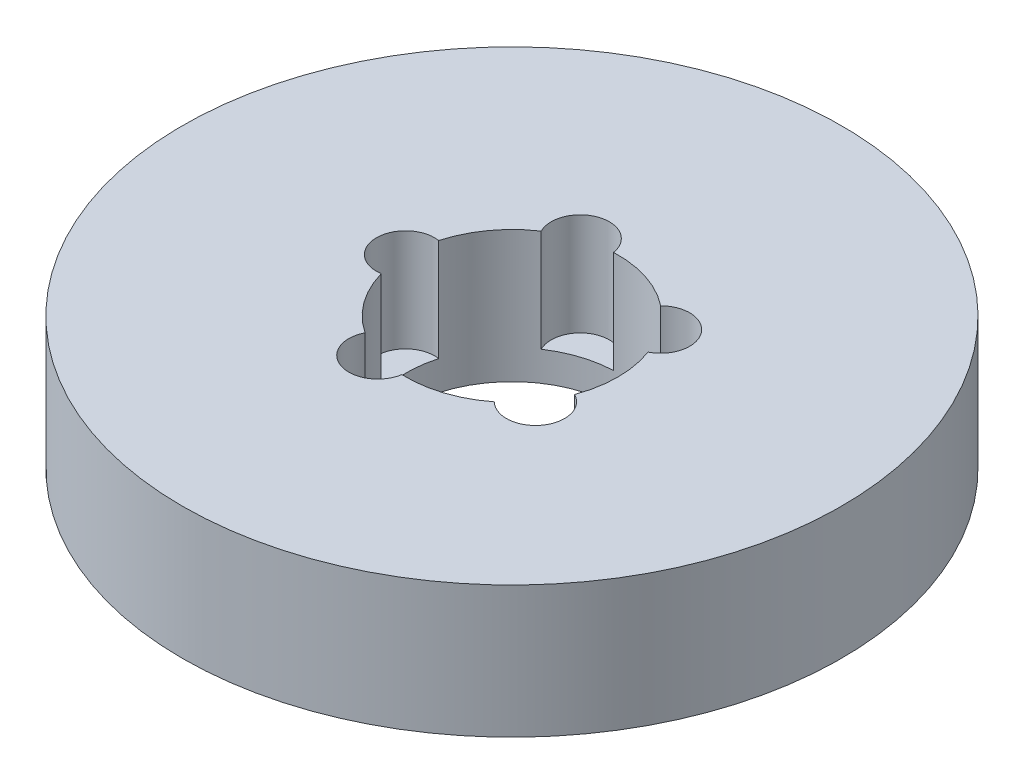
ISO-10303-21;
HEADER;
FILE_DESCRIPTION(('STEP AP214'),'2;1');
FILE_NAME('part.step','',(''),(''),'','','');
FILE_SCHEMA(('AUTOMOTIVE_DESIGN { 1 0 10303 214 1 1 1 1 }'));
ENDSEC;
DATA;
#1=APPLICATION_CONTEXT('core data for automotive mechanical design processes');
#2=APPLICATION_PROTOCOL_DEFINITION('international standard','automotive_design',2000,#1);
#3=PRODUCT_CONTEXT('',#1,'mechanical');
#4=PRODUCT('Part','Part','',(#3));
#5=PRODUCT_RELATED_PRODUCT_CATEGORY('part','',(#4));
#6=PRODUCT_DEFINITION_FORMATION('','',#4);
#7=PRODUCT_DEFINITION_CONTEXT('part definition',#1,'design');
#8=PRODUCT_DEFINITION('design','',#6,#7);
#9=PRODUCT_DEFINITION_SHAPE('','',#8);
#10=(LENGTH_UNIT() NAMED_UNIT(*) SI_UNIT(.MILLI.,.METRE.));
#11=(NAMED_UNIT(*) PLANE_ANGLE_UNIT() SI_UNIT($,.RADIAN.));
#12=(NAMED_UNIT(*) SI_UNIT($,.STERADIAN.) SOLID_ANGLE_UNIT());
#13=UNCERTAINTY_MEASURE_WITH_UNIT(LENGTH_MEASURE(1.E-05),#10,'distance_accuracy_value','');
#14=(GEOMETRIC_REPRESENTATION_CONTEXT(3) GLOBAL_UNCERTAINTY_ASSIGNED_CONTEXT((#13)) GLOBAL_UNIT_ASSIGNED_CONTEXT((#10,
#11,#12)) REPRESENTATION_CONTEXT('',''));
#15=CARTESIAN_POINT('',(0.,0.,0.));
#16=DIRECTION('',(0.,0.,1.));
#17=DIRECTION('',(1.,0.,0.));
#18=AXIS2_PLACEMENT_3D('',#15,#16,#17);
#19=CARTESIAN_POINT('',(0.,28.,0.));
#20=DIRECTION('',(0.,-1.,0.));
#21=DIRECTION('',(0.,0.,-1.));
#22=AXIS2_PLACEMENT_3D('',#19,#20,#21);
#23=CYLINDRICAL_SURFACE('',#22,70.);
#24=CARTESIAN_POINT('',(0.,28.,0.));
#25=DIRECTION('',(0.,1.,0.));
#26=DIRECTION('',(0.,0.,1.));
#27=AXIS2_PLACEMENT_3D('',#24,#25,#26);
#28=CIRCLE('',#27,70.);
#29=CARTESIAN_POINT('',(0.,28.,70.));
#30=VERTEX_POINT('',#29);
#31=EDGE_CURVE('E157',#30,#30,#28,.T.);
#32=ORIENTED_EDGE('',*,*,#31,.F.);
#33=EDGE_LOOP('',(#32));
#34=FACE_BOUND('',#33,.T.);
#35=CARTESIAN_POINT('',(0.,0.,0.));
#36=DIRECTION('',(0.,1.,0.));
#37=DIRECTION('',(0.,0.,1.));
#38=AXIS2_PLACEMENT_3D('',#35,#36,#37);
#39=CIRCLE('',#38,70.);
#40=CARTESIAN_POINT('',(0.,0.,70.));
#41=VERTEX_POINT('',#40);
#42=EDGE_CURVE('E150',#41,#41,#39,.T.);
#43=ORIENTED_EDGE('',*,*,#42,.T.);
#44=EDGE_LOOP('',(#43));
#45=FACE_BOUND('',#44,.T.);
#46=ADVANCED_FACE('F39',(#34,#45),#23,.T.);
#47=CARTESIAN_POINT('',(0.,28.,0.));
#48=DIRECTION('',(0.,1.,0.));
#49=DIRECTION('',(0.,0.,1.));
#50=AXIS2_PLACEMENT_3D('',#47,#48,#49);
#51=PLANE('',#50);
#52=CARTESIAN_POINT('',(-6.98564756048256,28.,-21.4996124934048));
#53=DIRECTION('',(0.,1.,0.));
#54=DIRECTION('',(-0.95105651629515,0.,0.309016994374958));
#55=AXIS2_PLACEMENT_3D('',#52,#53,#54);
#56=CIRCLE('',#55,6.17389329762064);
#57=CARTESIAN_POINT('',(-0.890473899078126,28.,-22.4823721220662));
#58=VERTEX_POINT('',#57);
#59=CARTESIAN_POINT('',(-12.4943982525009,28.,-18.7120285460423));
#60=VERTEX_POINT('',#59);
#61=EDGE_CURVE('E194',#58,#60,#56,.T.);
#62=ORIENTED_EDGE('',*,*,#61,.F.);
#63=CARTESIAN_POINT('',(0.,28.,0.));
#64=DIRECTION('',(0.,1.,0.));
#65=DIRECTION('',(0.,0.,1.));
#66=AXIS2_PLACEMENT_3D('',#63,#64,#65);
#67=CIRCLE('',#66,22.5);
#68=CARTESIAN_POINT('',(13.9352152873031,28.,-17.6652136951839));
#69=VERTEX_POINT('',#68);
#70=EDGE_CURVE('E147',#69,#58,#67,.T.);
#71=ORIENTED_EDGE('',*,*,#70,.F.);
#72=CARTESIAN_POINT('',(18.2886627467704,28.,-13.2874912658763));
#73=DIRECTION('',(0.,1.,0.));
#74=DIRECTION('',(-0.58778525229248,0.,-0.809016994374942));
#75=AXIS2_PLACEMENT_3D('',#72,#73,#74);
#76=CIRCLE('',#75,6.17389329762064);
#77=CARTESIAN_POINT('',(21.1068349406011,28.,-7.79432606388897));
#78=VERTEX_POINT('',#77);
#79=EDGE_CURVE('E254',#78,#69,#76,.T.);
#80=ORIENTED_EDGE('',*,*,#79,.F.);
#81=CARTESIAN_POINT('',(21.1068349406013,28.,7.79432606388866));
#82=VERTEX_POINT('',#81);
#83=EDGE_CURVE('E144',#82,#78,#67,.T.);
#84=ORIENTED_EDGE('',*,*,#83,.F.);
#85=CARTESIAN_POINT('',(18.2886627467706,28.,13.287491265876));
#86=DIRECTION('',(0.,1.,0.));
#87=DIRECTION('',(0.587785252292469,0.,-0.809016994374951));
#88=AXIS2_PLACEMENT_3D('',#85,#86,#87);
#89=CIRCLE('',#88,6.17389329762064);
#90=CARTESIAN_POINT('',(13.9352152873034,28.,17.6652136951837));
#91=VERTEX_POINT('',#90);
#92=EDGE_CURVE('E141',#91,#82,#89,.T.);
#93=ORIENTED_EDGE('',*,*,#92,.F.);
#94=CARTESIAN_POINT('',(-0.890473899077807,28.,22.4823721220662));
#95=VERTEX_POINT('',#94);
#96=EDGE_CURVE('E134',#95,#91,#67,.T.);
#97=ORIENTED_EDGE('',*,*,#96,.F.);
#98=CARTESIAN_POINT('',(-6.98564756048225,28.,21.4996124934049));
#99=DIRECTION('',(0.,1.,0.));
#100=DIRECTION('',(0.951056516295155,0.,0.309016994374945));
#101=AXIS2_PLACEMENT_3D('',#98,#99,#100);
#102=CIRCLE('',#101,6.17389329762064);
#103=CARTESIAN_POINT('',(-12.4943982525006,28.,18.7120285460425));
#104=VERTEX_POINT('',#103);
#105=EDGE_CURVE('E111',#104,#95,#102,.T.);
#106=ORIENTED_EDGE('',*,*,#105,.F.);
#107=CARTESIAN_POINT('',(-21.657178076326,28.,6.10054405527126));
#108=VERTEX_POINT('',#107);
#109=EDGE_CURVE('E145',#108,#104,#67,.T.);
#110=ORIENTED_EDGE('',*,*,#109,.F.);
#111=CARTESIAN_POINT('',(-22.6060303725763,28.,0.));
#112=DIRECTION('',(0.,1.,0.));
#113=DIRECTION('',(0.,0.,1.));
#114=AXIS2_PLACEMENT_3D('',#111,#112,#113);
#115=CIRCLE('',#114,6.17389329762064);
#116=CARTESIAN_POINT('',(-21.657178076326,28.,-6.10054405527126));
#117=VERTEX_POINT('',#116);
#118=EDGE_CURVE('E153',#117,#108,#115,.T.);
#119=ORIENTED_EDGE('',*,*,#118,.F.);
#120=EDGE_CURVE('E146',#60,#117,#67,.T.);
#121=ORIENTED_EDGE('',*,*,#120,.F.);
#122=EDGE_LOOP('',(#62,#71,#80,#84,#93,#97,#106,#110,#119,#121));
#123=FACE_BOUND('',#122,.T.);
#124=ORIENTED_EDGE('',*,*,#31,.T.);
#125=EDGE_LOOP('',(#124));
#126=FACE_BOUND('',#125,.T.);
#127=ADVANCED_FACE('F139',(#123,#126),#51,.T.);
#128=CARTESIAN_POINT('',(0.,0.,0.));
#129=DIRECTION('',(0.,1.,0.));
#130=DIRECTION('',(0.,0.,1.));
#131=AXIS2_PLACEMENT_3D('',#128,#129,#130);
#132=PLANE('',#131);
#133=CARTESIAN_POINT('',(0.,0.,0.));
#134=DIRECTION('',(0.,1.,0.));
#135=DIRECTION('',(0.,0.,1.));
#136=AXIS2_PLACEMENT_3D('',#133,#134,#135);
#137=CIRCLE('',#136,22.5);
#138=CARTESIAN_POINT('',(0.,0.,22.5));
#139=VERTEX_POINT('',#138);
#140=EDGE_CURVE('E154',#139,#139,#137,.T.);
#141=ORIENTED_EDGE('',*,*,#140,.T.);
#142=EDGE_LOOP('',(#141));
#143=FACE_BOUND('',#142,.T.);
#144=ORIENTED_EDGE('',*,*,#42,.F.);
#145=EDGE_LOOP('',(#144));
#146=FACE_BOUND('',#145,.T.);
#147=ADVANCED_FACE('F213',(#143,#146),#132,.F.);
#148=CARTESIAN_POINT('',(0.,28.,0.));
#149=DIRECTION('',(0.,-1.,0.));
#150=DIRECTION('',(0.,0.,-1.));
#151=AXIS2_PLACEMENT_3D('',#148,#149,#150);
#152=CYLINDRICAL_SURFACE('',#151,22.5);
#153=DIRECTION('',(0.,1.,0.));
#154=VECTOR('',#153,1.);
#155=CARTESIAN_POINT('',(-0.890473899078125,17.1361411445463,-22.4823721220662));
#156=LINE('',#155,#154);
#157=CARTESIAN_POINT('',(-0.890473899078126,6.27228228909267,-22.4823721220662));
#158=VERTEX_POINT('',#157);
#159=EDGE_CURVE('E11',#158,#58,#156,.T.);
#160=ORIENTED_EDGE('',*,*,#159,.F.);
#161=CARTESIAN_POINT('',(0.,6.27228228909267,0.));
#162=DIRECTION('',(0.,1.,0.));
#163=DIRECTION('',(0.,0.,1.));
#164=AXIS2_PLACEMENT_3D('',#161,#162,#163);
#165=CIRCLE('',#164,22.5);
#166=CARTESIAN_POINT('',(-12.4943982525009,6.27228228909267,-18.7120285460423));
#167=VERTEX_POINT('',#166);
#168=EDGE_CURVE('E189',#158,#167,#165,.T.);
#169=ORIENTED_EDGE('',*,*,#168,.T.);
#170=DIRECTION('',(0.,1.,0.));
#171=VECTOR('',#170,1.);
#172=CARTESIAN_POINT('',(-12.4943982525009,17.1361411445463,-18.7120285460423));
#173=LINE('',#172,#171);
#174=EDGE_CURVE('E46',#60,#167,#173,.F.);
#175=ORIENTED_EDGE('',*,*,#174,.F.);
#176=ORIENTED_EDGE('',*,*,#120,.T.);
#177=DIRECTION('',(0.,1.,0.));
#178=VECTOR('',#177,1.);
#179=CARTESIAN_POINT('',(-21.657178076326,17.1361411445463,-6.10054405527126));
#180=LINE('',#179,#178);
#181=CARTESIAN_POINT('',(-21.657178076326,6.27228228909267,-6.10054405527126));
#182=VERTEX_POINT('',#181);
#183=EDGE_CURVE('E168',#182,#117,#180,.T.);
#184=ORIENTED_EDGE('',*,*,#183,.F.);
#185=CARTESIAN_POINT('',(0.,6.27228228909267,0.));
#186=DIRECTION('',(0.,1.,0.));
#187=DIRECTION('',(0.,0.,1.));
#188=AXIS2_PLACEMENT_3D('',#185,#186,#187);
#189=CIRCLE('',#188,22.5);
#190=CARTESIAN_POINT('',(-21.657178076326,6.27228228909267,6.10054405527126));
#191=VERTEX_POINT('',#190);
#192=EDGE_CURVE('E165',#182,#191,#189,.T.);
#193=ORIENTED_EDGE('',*,*,#192,.T.);
#194=DIRECTION('',(0.,1.,0.));
#195=VECTOR('',#194,1.);
#196=CARTESIAN_POINT('',(-21.657178076326,17.1361411445463,6.10054405527126));
#197=LINE('',#196,#195);
#198=EDGE_CURVE('E170',#108,#191,#197,.F.);
#199=ORIENTED_EDGE('',*,*,#198,.F.);
#200=ORIENTED_EDGE('',*,*,#109,.T.);
#201=DIRECTION('',(0.,1.,0.));
#202=VECTOR('',#201,1.);
#203=CARTESIAN_POINT('',(-12.4943982525006,17.1361411445463,18.7120285460425));
#204=LINE('',#203,#202);
#205=CARTESIAN_POINT('',(-12.4943982525006,6.27228228909267,18.7120285460425));
#206=VERTEX_POINT('',#205);
#207=EDGE_CURVE('E121',#206,#104,#204,.T.);
#208=ORIENTED_EDGE('',*,*,#207,.F.);
#209=CARTESIAN_POINT('',(0.,6.27228228909267,0.));
#210=DIRECTION('',(0.,1.,0.));
#211=DIRECTION('',(0.,0.,1.));
#212=AXIS2_PLACEMENT_3D('',#209,#210,#211);
#213=CIRCLE('',#212,22.5);
#214=CARTESIAN_POINT('',(-0.890473899077807,6.27228228909267,22.4823721220662));
#215=VERTEX_POINT('',#214);
#216=EDGE_CURVE('E136',#206,#215,#213,.T.);
#217=ORIENTED_EDGE('',*,*,#216,.T.);
#218=DIRECTION('',(0.,1.,0.));
#219=VECTOR('',#218,1.);
#220=CARTESIAN_POINT('',(-0.890473899077807,17.1361411445463,22.4823721220662));
#221=LINE('',#220,#219);
#222=EDGE_CURVE('E117',#95,#215,#221,.F.);
#223=ORIENTED_EDGE('',*,*,#222,.F.);
#224=ORIENTED_EDGE('',*,*,#96,.T.);
#225=DIRECTION('',(0.,1.,0.));
#226=VECTOR('',#225,1.);
#227=CARTESIAN_POINT('',(13.9352152873034,17.1361411445463,17.6652136951837));
#228=LINE('',#227,#226);
#229=CARTESIAN_POINT('',(13.9352152873034,6.27228228909267,17.6652136951837));
#230=VERTEX_POINT('',#229);
#231=EDGE_CURVE('E182',#230,#91,#228,.T.);
#232=ORIENTED_EDGE('',*,*,#231,.F.);
#233=CARTESIAN_POINT('',(0.,6.27228228909267,0.));
#234=DIRECTION('',(0.,1.,0.));
#235=DIRECTION('',(0.,0.,1.));
#236=AXIS2_PLACEMENT_3D('',#233,#234,#235);
#237=CIRCLE('',#236,22.5);
#238=CARTESIAN_POINT('',(21.1068349406013,6.27228228909267,7.79432606388866));
#239=VERTEX_POINT('',#238);
#240=EDGE_CURVE('E174',#230,#239,#237,.T.);
#241=ORIENTED_EDGE('',*,*,#240,.T.);
#242=DIRECTION('',(0.,1.,0.));
#243=VECTOR('',#242,1.);
#244=CARTESIAN_POINT('',(21.1068349406013,17.1361411445463,7.79432606388866));
#245=LINE('',#244,#243);
#246=EDGE_CURVE('E177',#82,#239,#245,.F.);
#247=ORIENTED_EDGE('',*,*,#246,.F.);
#248=ORIENTED_EDGE('',*,*,#83,.T.);
#249=DIRECTION('',(0.,1.,0.));
#250=VECTOR('',#249,1.);
#251=CARTESIAN_POINT('',(21.1068349406011,17.1361411445463,-7.79432606388896));
#252=LINE('',#251,#250);
#253=CARTESIAN_POINT('',(21.1068349406011,6.27228228909267,-7.79432606388897));
#254=VERTEX_POINT('',#253);
#255=EDGE_CURVE('E187',#254,#78,#252,.T.);
#256=ORIENTED_EDGE('',*,*,#255,.F.);
#257=CARTESIAN_POINT('',(0.,6.27228228909267,0.));
#258=DIRECTION('',(0.,1.,0.));
#259=DIRECTION('',(0.,0.,1.));
#260=AXIS2_PLACEMENT_3D('',#257,#258,#259);
#261=CIRCLE('',#260,22.5);
#262=CARTESIAN_POINT('',(13.9352152873031,6.27228228909267,-17.6652136951839));
#263=VERTEX_POINT('',#262);
#264=EDGE_CURVE('E181',#254,#263,#261,.T.);
#265=ORIENTED_EDGE('',*,*,#264,.T.);
#266=DIRECTION('',(0.,1.,0.));
#267=VECTOR('',#266,1.);
#268=CARTESIAN_POINT('',(13.9352152873031,17.1361411445463,-17.6652136951839));
#269=LINE('',#268,#267);
#270=EDGE_CURVE('E186',#69,#263,#269,.F.);
#271=ORIENTED_EDGE('',*,*,#270,.F.);
#272=ORIENTED_EDGE('',*,*,#70,.T.);
#273=EDGE_LOOP('',(#160,#169,#175,#176,#184,#193,#199,#200,#208,#217,#223,#224,#232,#241,#247,
#248,#256,#265,#271,#272));
#274=FACE_BOUND('',#273,.T.);
#275=ORIENTED_EDGE('',*,*,#140,.F.);
#276=EDGE_LOOP('',(#275));
#277=FACE_BOUND('',#276,.T.);
#278=ADVANCED_FACE('F135',(#274,#277),#152,.F.);
#279=CARTESIAN_POINT('',(-22.6060303725763,6.27228228909267,0.));
#280=DIRECTION('',(0.,1.,0.));
#281=DIRECTION('',(0.,0.,1.));
#282=AXIS2_PLACEMENT_3D('',#279,#280,#281);
#283=CYLINDRICAL_SURFACE('',#282,6.17389329762064);
#284=ORIENTED_EDGE('',*,*,#183,.T.);
#285=ORIENTED_EDGE('',*,*,#118,.T.);
#286=ORIENTED_EDGE('',*,*,#198,.T.);
#287=CARTESIAN_POINT('',(-22.6060303725763,6.27228228909267,0.));
#288=DIRECTION('',(0.,1.,0.));
#289=DIRECTION('',(0.,0.,1.));
#290=AXIS2_PLACEMENT_3D('',#287,#288,#289);
#291=CIRCLE('',#290,6.17389329762064);
#292=EDGE_CURVE('E158',#182,#191,#291,.T.);
#293=ORIENTED_EDGE('',*,*,#292,.F.);
#294=EDGE_LOOP('',(#284,#285,#286,#293));
#295=FACE_BOUND('',#294,.T.);
#296=ADVANCED_FACE('F221',(#295),#283,.F.);
#297=CARTESIAN_POINT('',(-22.6060303725763,6.27228228909267,0.));
#298=DIRECTION('',(0.,1.,0.));
#299=DIRECTION('',(0.,0.,1.));
#300=AXIS2_PLACEMENT_3D('',#297,#298,#299);
#301=PLANE('',#300);
#302=ORIENTED_EDGE('',*,*,#292,.T.);
#303=ORIENTED_EDGE('',*,*,#192,.F.);
#304=EDGE_LOOP('',(#302,#303));
#305=FACE_BOUND('',#304,.T.);
#306=ADVANCED_FACE('F227',(#305),#301,.T.);
#307=CARTESIAN_POINT('',(-6.98564756048225,6.27228228909267,21.4996124934049));
#308=DIRECTION('',(0.,1.,0.));
#309=DIRECTION('',(0.,0.,1.));
#310=AXIS2_PLACEMENT_3D('',#307,#308,#309);
#311=CYLINDRICAL_SURFACE('',#310,6.17389329762064);
#312=ORIENTED_EDGE('',*,*,#207,.T.);
#313=ORIENTED_EDGE('',*,*,#105,.T.);
#314=ORIENTED_EDGE('',*,*,#222,.T.);
#315=CARTESIAN_POINT('',(-6.98564756048225,6.27228228909267,21.4996124934049));
#316=DIRECTION('',(0.,1.,0.));
#317=DIRECTION('',(0.951056516295155,0.,0.309016994374945));
#318=AXIS2_PLACEMENT_3D('',#315,#316,#317);
#319=CIRCLE('',#318,6.17389329762064);
#320=EDGE_CURVE('E127',#206,#215,#319,.T.);
#321=ORIENTED_EDGE('',*,*,#320,.F.);
#322=EDGE_LOOP('',(#312,#313,#314,#321));
#323=FACE_BOUND('',#322,.T.);
#324=ADVANCED_FACE('F116',(#323),#311,.F.);
#325=CARTESIAN_POINT('',(-6.98564756048225,6.27228228909267,21.4996124934049));
#326=DIRECTION('',(0.,1.,0.));
#327=DIRECTION('',(0.951056516295155,0.,0.309016994374945));
#328=AXIS2_PLACEMENT_3D('',#325,#326,#327);
#329=PLANE('',#328);
#330=ORIENTED_EDGE('',*,*,#320,.T.);
#331=ORIENTED_EDGE('',*,*,#216,.F.);
#332=EDGE_LOOP('',(#330,#331));
#333=FACE_BOUND('',#332,.T.);
#334=ADVANCED_FACE('F234',(#333),#329,.T.);
#335=CARTESIAN_POINT('',(18.2886627467706,6.27228228909267,13.287491265876));
#336=DIRECTION('',(0.,1.,0.));
#337=DIRECTION('',(0.,0.,1.));
#338=AXIS2_PLACEMENT_3D('',#335,#336,#337);
#339=CYLINDRICAL_SURFACE('',#338,6.17389329762064);
#340=ORIENTED_EDGE('',*,*,#231,.T.);
#341=ORIENTED_EDGE('',*,*,#92,.T.);
#342=ORIENTED_EDGE('',*,*,#246,.T.);
#343=CARTESIAN_POINT('',(18.2886627467706,6.27228228909267,13.287491265876));
#344=DIRECTION('',(0.,1.,0.));
#345=DIRECTION('',(0.587785252292469,0.,-0.809016994374951));
#346=AXIS2_PLACEMENT_3D('',#343,#344,#345);
#347=CIRCLE('',#346,6.17389329762064);
#348=EDGE_CURVE('E130',#230,#239,#347,.T.);
#349=ORIENTED_EDGE('',*,*,#348,.F.);
#350=EDGE_LOOP('',(#340,#341,#342,#349));
#351=FACE_BOUND('',#350,.T.);
#352=ADVANCED_FACE('F240',(#351),#339,.F.);
#353=CARTESIAN_POINT('',(18.2886627467706,6.27228228909267,13.287491265876));
#354=DIRECTION('',(0.,1.,0.));
#355=DIRECTION('',(0.587785252292469,0.,-0.809016994374951));
#356=AXIS2_PLACEMENT_3D('',#353,#354,#355);
#357=PLANE('',#356);
#358=ORIENTED_EDGE('',*,*,#348,.T.);
#359=ORIENTED_EDGE('',*,*,#240,.F.);
#360=EDGE_LOOP('',(#358,#359));
#361=FACE_BOUND('',#360,.T.);
#362=ADVANCED_FACE('F245',(#361),#357,.T.);
#363=CARTESIAN_POINT('',(18.2886627467704,6.27228228909267,-13.2874912658763));
#364=DIRECTION('',(0.,1.,0.));
#365=DIRECTION('',(0.,0.,1.));
#366=AXIS2_PLACEMENT_3D('',#363,#364,#365);
#367=CYLINDRICAL_SURFACE('',#366,6.17389329762064);
#368=ORIENTED_EDGE('',*,*,#255,.T.);
#369=ORIENTED_EDGE('',*,*,#79,.T.);
#370=ORIENTED_EDGE('',*,*,#270,.T.);
#371=CARTESIAN_POINT('',(18.2886627467704,6.27228228909267,-13.2874912658763));
#372=DIRECTION('',(0.,1.,0.));
#373=DIRECTION('',(-0.58778525229248,0.,-0.809016994374942));
#374=AXIS2_PLACEMENT_3D('',#371,#372,#373);
#375=CIRCLE('',#374,6.17389329762064);
#376=EDGE_CURVE('E56',#254,#263,#375,.T.);
#377=ORIENTED_EDGE('',*,*,#376,.F.);
#378=EDGE_LOOP('',(#368,#369,#370,#377));
#379=FACE_BOUND('',#378,.T.);
#380=ADVANCED_FACE('F266',(#379),#367,.F.);
#381=CARTESIAN_POINT('',(18.2886627467704,6.27228228909267,-13.2874912658763));
#382=DIRECTION('',(0.,1.,0.));
#383=DIRECTION('',(-0.58778525229248,0.,-0.809016994374942));
#384=AXIS2_PLACEMENT_3D('',#381,#382,#383);
#385=PLANE('',#384);
#386=ORIENTED_EDGE('',*,*,#376,.T.);
#387=ORIENTED_EDGE('',*,*,#264,.F.);
#388=EDGE_LOOP('',(#386,#387));
#389=FACE_BOUND('',#388,.T.);
#390=ADVANCED_FACE('F204',(#389),#385,.T.);
#391=CARTESIAN_POINT('',(-6.98564756048256,6.27228228909267,-21.4996124934048));
#392=DIRECTION('',(0.,1.,0.));
#393=DIRECTION('',(0.,0.,1.));
#394=AXIS2_PLACEMENT_3D('',#391,#392,#393);
#395=CYLINDRICAL_SURFACE('',#394,6.17389329762064);
#396=ORIENTED_EDGE('',*,*,#159,.T.);
#397=ORIENTED_EDGE('',*,*,#61,.T.);
#398=ORIENTED_EDGE('',*,*,#174,.T.);
#399=CARTESIAN_POINT('',(-6.98564756048256,6.27228228909267,-21.4996124934048));
#400=DIRECTION('',(0.,1.,0.));
#401=DIRECTION('',(-0.95105651629515,0.,0.309016994374958));
#402=AXIS2_PLACEMENT_3D('',#399,#400,#401);
#403=CIRCLE('',#402,6.17389329762064);
#404=EDGE_CURVE('E55',#158,#167,#403,.T.);
#405=ORIENTED_EDGE('',*,*,#404,.F.);
#406=EDGE_LOOP('',(#396,#397,#398,#405));
#407=FACE_BOUND('',#406,.T.);
#408=ADVANCED_FACE('F193',(#407),#395,.F.);
#409=CARTESIAN_POINT('',(-6.98564756048256,6.27228228909267,-21.4996124934048));
#410=DIRECTION('',(0.,1.,0.));
#411=DIRECTION('',(-0.95105651629515,0.,0.309016994374958));
#412=AXIS2_PLACEMENT_3D('',#409,#410,#411);
#413=PLANE('',#412);
#414=ORIENTED_EDGE('',*,*,#404,.T.);
#415=ORIENTED_EDGE('',*,*,#168,.F.);
#416=EDGE_LOOP('',(#414,#415));
#417=FACE_BOUND('',#416,.T.);
#418=ADVANCED_FACE('F196',(#417),#413,.T.);
#419=CLOSED_SHELL('',(#46,#127,#147,#278,#296,#306,#324,#334,#352,#362,#380,#390,#408,#418));
#420=MANIFOLD_SOLID_BREP('B2',#419);
#421=ADVANCED_BREP_SHAPE_REPRESENTATION('',(#18,#420),#14);
#422=SHAPE_DEFINITION_REPRESENTATION(#9,#421);
ENDSEC;
END-ISO-10303-21;
